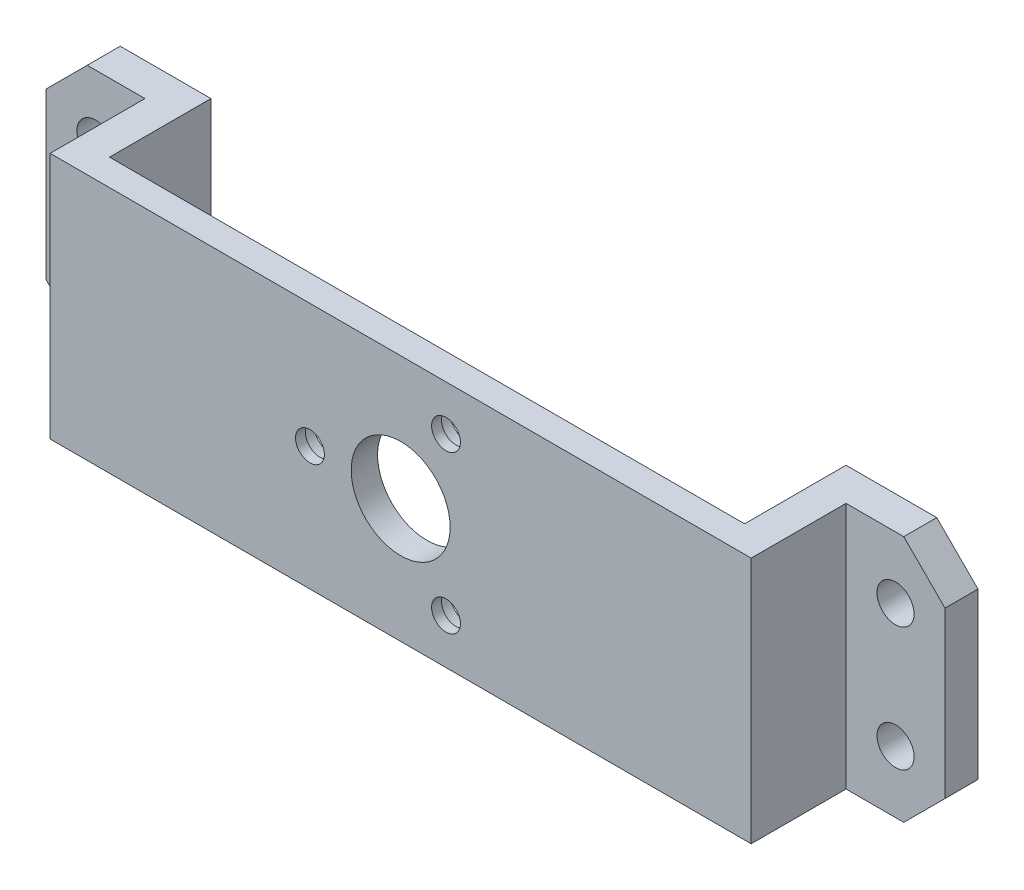
ISO-10303-21;
HEADER;
FILE_DESCRIPTION(('STEP AP214'),'2;1');
FILE_NAME('part.step','',(''),(''),'','','');
FILE_SCHEMA(('AUTOMOTIVE_DESIGN { 1 0 10303 214 1 1 1 1 }'));
ENDSEC;
DATA;
#1=APPLICATION_CONTEXT('core data for automotive mechanical design processes');
#2=APPLICATION_PROTOCOL_DEFINITION('international standard','automotive_design',2000,#1);
#3=PRODUCT_CONTEXT('',#1,'mechanical');
#4=PRODUCT('Part','Part','',(#3));
#5=PRODUCT_RELATED_PRODUCT_CATEGORY('part','',(#4));
#6=PRODUCT_DEFINITION_FORMATION('','',#4);
#7=PRODUCT_DEFINITION_CONTEXT('part definition',#1,'design');
#8=PRODUCT_DEFINITION('design','',#6,#7);
#9=PRODUCT_DEFINITION_SHAPE('','',#8);
#10=(LENGTH_UNIT() NAMED_UNIT(*) SI_UNIT(.MILLI.,.METRE.));
#11=(NAMED_UNIT(*) PLANE_ANGLE_UNIT() SI_UNIT($,.RADIAN.));
#12=(NAMED_UNIT(*) SI_UNIT($,.STERADIAN.) SOLID_ANGLE_UNIT());
#13=UNCERTAINTY_MEASURE_WITH_UNIT(LENGTH_MEASURE(1.E-05),#10,'distance_accuracy_value','');
#14=(GEOMETRIC_REPRESENTATION_CONTEXT(3) GLOBAL_UNCERTAINTY_ASSIGNED_CONTEXT((#13)) GLOBAL_UNIT_ASSIGNED_CONTEXT((#10,
#11,#12)) REPRESENTATION_CONTEXT('',''));
#15=CARTESIAN_POINT('',(0.,0.,0.));
#16=DIRECTION('',(0.,0.,1.));
#17=DIRECTION('',(1.,0.,0.));
#18=AXIS2_PLACEMENT_3D('',#15,#16,#17);
#19=CARTESIAN_POINT('',(42.5,-15.,3.2));
#20=DIRECTION('',(-1.,0.,0.));
#21=DIRECTION('',(0.,0.,1.));
#22=AXIS2_PLACEMENT_3D('',#19,#20,#21);
#23=PLANE('',#22);
#24=DIRECTION('',(0.,-1.,0.));
#25=VECTOR('',#24,1.);
#26=CARTESIAN_POINT('',(42.5,-15.,-8.3));
#27=LINE('',#26,#25);
#28=CARTESIAN_POINT('',(42.5,15.,-8.3));
#29=VERTEX_POINT('',#28);
#30=CARTESIAN_POINT('',(42.5,-15.,-8.3));
#31=VERTEX_POINT('',#30);
#32=EDGE_CURVE('E156',#29,#31,#27,.T.);
#33=ORIENTED_EDGE('',*,*,#32,.F.);
#34=DIRECTION('',(0.,0.,-1.));
#35=VECTOR('',#34,1.);
#36=CARTESIAN_POINT('',(42.5,15.,3.2));
#37=LINE('',#36,#35);
#38=CARTESIAN_POINT('',(42.5,15.,3.2));
#39=VERTEX_POINT('',#38);
#40=EDGE_CURVE('E170',#39,#29,#37,.T.);
#41=ORIENTED_EDGE('',*,*,#40,.F.);
#42=DIRECTION('',(0.,1.,0.));
#43=VECTOR('',#42,1.);
#44=CARTESIAN_POINT('',(42.5,-15.,3.2));
#45=LINE('',#44,#43);
#46=CARTESIAN_POINT('',(42.5,-15.,3.2));
#47=VERTEX_POINT('',#46);
#48=EDGE_CURVE('E386',#47,#39,#45,.T.);
#49=ORIENTED_EDGE('',*,*,#48,.F.);
#50=DIRECTION('',(0.,0.,-1.));
#51=VECTOR('',#50,1.);
#52=CARTESIAN_POINT('',(42.5,-15.,3.2));
#53=LINE('',#52,#51);
#54=EDGE_CURVE('E172',#47,#31,#53,.T.);
#55=ORIENTED_EDGE('',*,*,#54,.T.);
#56=EDGE_LOOP('',(#33,#41,#49,#55));
#57=FACE_BOUND('',#56,.T.);
#58=ADVANCED_FACE('F40',(#57),#23,.F.);
#59=CARTESIAN_POINT('',(0.,0.,0.));
#60=DIRECTION('',(0.,0.,-1.));
#61=DIRECTION('',(-1.,0.,0.));
#62=AXIS2_PLACEMENT_3D('',#59,#60,#61);
#63=PLANE('',#62);
#64=CARTESIAN_POINT('',(5.50000000000004,9.5262794416288,0.));
#65=DIRECTION('',(0.,0.,-1.));
#66=DIRECTION('',(-1.,0.,0.));
#67=AXIS2_PLACEMENT_3D('',#64,#65,#66);
#68=CIRCLE('',#67,3.);
#69=CARTESIAN_POINT('',(2.50000000000004,9.5262794416288,0.));
#70=VERTEX_POINT('',#69);
#71=EDGE_CURVE('E347',#70,#70,#68,.T.);
#72=ORIENTED_EDGE('',*,*,#71,.F.);
#73=EDGE_LOOP('',(#72));
#74=FACE_BOUND('',#73,.T.);
#75=CARTESIAN_POINT('',(-11.,0.,0.));
#76=DIRECTION('',(0.,0.,-1.));
#77=DIRECTION('',(-1.,0.,0.));
#78=AXIS2_PLACEMENT_3D('',#75,#76,#77);
#79=CIRCLE('',#78,3.);
#80=CARTESIAN_POINT('',(-14.,0.,0.));
#81=VERTEX_POINT('',#80);
#82=EDGE_CURVE('E355',#81,#81,#79,.T.);
#83=ORIENTED_EDGE('',*,*,#82,.F.);
#84=EDGE_LOOP('',(#83));
#85=FACE_BOUND('',#84,.T.);
#86=CARTESIAN_POINT('',(5.50000000000005,-9.5262794416288,0.));
#87=DIRECTION('',(0.,0.,-1.));
#88=DIRECTION('',(-1.,0.,0.));
#89=AXIS2_PLACEMENT_3D('',#86,#87,#88);
#90=CIRCLE('',#89,3.);
#91=CARTESIAN_POINT('',(2.50000000000005,-9.5262794416288,0.));
#92=VERTEX_POINT('',#91);
#93=EDGE_CURVE('E332',#92,#92,#90,.T.);
#94=ORIENTED_EDGE('',*,*,#93,.F.);
#95=EDGE_LOOP('',(#94));
#96=FACE_BOUND('',#95,.T.);
#97=CARTESIAN_POINT('',(0.,0.,0.));
#98=DIRECTION('',(0.,0.,1.));
#99=DIRECTION('',(1.,0.,0.));
#100=AXIS2_PLACEMENT_3D('',#97,#98,#99);
#101=CIRCLE('',#100,6.);
#102=CARTESIAN_POINT('',(6.,0.,0.));
#103=VERTEX_POINT('',#102);
#104=EDGE_CURVE('E370',#103,#103,#101,.T.);
#105=ORIENTED_EDGE('',*,*,#104,.T.);
#106=EDGE_LOOP('',(#105));
#107=FACE_BOUND('',#106,.T.);
#108=DIRECTION('',(-1.,0.,0.));
#109=VECTOR('',#108,1.);
#110=CARTESIAN_POINT('',(-42.5,15.,0.));
#111=LINE('',#110,#109);
#112=CARTESIAN_POINT('',(38.5,15.,0.));
#113=VERTEX_POINT('',#112);
#114=CARTESIAN_POINT('',(-38.5,15.,0.));
#115=VERTEX_POINT('',#114);
#116=EDGE_CURVE('E382',#113,#115,#111,.T.);
#117=ORIENTED_EDGE('',*,*,#116,.F.);
#118=DIRECTION('',(0.,1.,0.));
#119=VECTOR('',#118,1.);
#120=CARTESIAN_POINT('',(38.5,-15.,0.));
#121=LINE('',#120,#119);
#122=CARTESIAN_POINT('',(38.5,-15.,0.));
#123=VERTEX_POINT('',#122);
#124=EDGE_CURVE('E303',#123,#113,#121,.T.);
#125=ORIENTED_EDGE('',*,*,#124,.F.);
#126=DIRECTION('',(1.,0.,0.));
#127=VECTOR('',#126,1.);
#128=CARTESIAN_POINT('',(-42.5,-15.,0.));
#129=LINE('',#128,#127);
#130=CARTESIAN_POINT('',(-38.5,-15.,0.));
#131=VERTEX_POINT('',#130);
#132=EDGE_CURVE('E389',#131,#123,#129,.T.);
#133=ORIENTED_EDGE('',*,*,#132,.F.);
#134=DIRECTION('',(0.,-1.,0.));
#135=VECTOR('',#134,1.);
#136=CARTESIAN_POINT('',(-38.5,-15.,0.));
#137=LINE('',#136,#135);
#138=EDGE_CURVE('E323',#115,#131,#137,.T.);
#139=ORIENTED_EDGE('',*,*,#138,.F.);
#140=EDGE_LOOP('',(#117,#125,#133,#139));
#141=FACE_BOUND('',#140,.T.);
#142=ADVANCED_FACE('F441',(#74,#85,#96,#107,#141),#63,.T.);
#143=CARTESIAN_POINT('',(5.50000000000005,-9.5262794416288,0.));
#144=DIRECTION('',(0.,0.,1.));
#145=DIRECTION('',(1.,0.,0.));
#146=AXIS2_PLACEMENT_3D('',#143,#144,#145);
#147=CYLINDRICAL_SURFACE('',#146,1.75);
#148=CARTESIAN_POINT('',(5.50000000000005,-9.5262794416288,3.2));
#149=DIRECTION('',(0.,0.,1.));
#150=DIRECTION('',(1.,0.,0.));
#151=AXIS2_PLACEMENT_3D('',#148,#149,#150);
#152=CIRCLE('',#151,1.75);
#153=CARTESIAN_POINT('',(7.25000000000005,-9.5262794416288,3.2));
#154=VERTEX_POINT('',#153);
#155=EDGE_CURVE('E207',#154,#154,#152,.T.);
#156=ORIENTED_EDGE('',*,*,#155,.T.);
#157=EDGE_LOOP('',(#156));
#158=FACE_BOUND('',#157,.T.);
#159=CARTESIAN_POINT('',(5.50000000000005,-9.5262794416288,2.));
#160=DIRECTION('',(0.,0.,-1.));
#161=DIRECTION('',(-1.,0.,0.));
#162=AXIS2_PLACEMENT_3D('',#159,#160,#161);
#163=CIRCLE('',#162,1.75);
#164=CARTESIAN_POINT('',(3.75000000000005,-9.5262794416288,2.));
#165=VERTEX_POINT('',#164);
#166=EDGE_CURVE('E204',#165,#165,#163,.F.);
#167=ORIENTED_EDGE('',*,*,#166,.F.);
#168=EDGE_LOOP('',(#167));
#169=FACE_BOUND('',#168,.T.);
#170=ADVANCED_FACE('F461',(#158,#169),#147,.F.);
#171=CARTESIAN_POINT('',(-11.,0.,0.));
#172=DIRECTION('',(0.,0.,1.));
#173=DIRECTION('',(1.,0.,0.));
#174=AXIS2_PLACEMENT_3D('',#171,#172,#173);
#175=CYLINDRICAL_SURFACE('',#174,1.75);
#176=CARTESIAN_POINT('',(-11.,0.,3.2));
#177=DIRECTION('',(0.,0.,1.));
#178=DIRECTION('',(1.,0.,0.));
#179=AXIS2_PLACEMENT_3D('',#176,#177,#178);
#180=CIRCLE('',#179,1.75);
#181=CARTESIAN_POINT('',(-9.25,0.,3.2));
#182=VERTEX_POINT('',#181);
#183=EDGE_CURVE('E371',#182,#182,#180,.T.);
#184=ORIENTED_EDGE('',*,*,#183,.T.);
#185=EDGE_LOOP('',(#184));
#186=FACE_BOUND('',#185,.T.);
#187=CARTESIAN_POINT('',(-11.,0.,2.));
#188=DIRECTION('',(0.,0.,-1.));
#189=DIRECTION('',(-1.,0.,0.));
#190=AXIS2_PLACEMENT_3D('',#187,#188,#189);
#191=CIRCLE('',#190,1.75);
#192=CARTESIAN_POINT('',(-12.75,0.,2.));
#193=VERTEX_POINT('',#192);
#194=EDGE_CURVE('E199',#193,#193,#191,.F.);
#195=ORIENTED_EDGE('',*,*,#194,.F.);
#196=EDGE_LOOP('',(#195));
#197=FACE_BOUND('',#196,.T.);
#198=ADVANCED_FACE('F529',(#186,#197),#175,.F.);
#199=CARTESIAN_POINT('',(5.50000000000004,9.5262794416288,0.));
#200=DIRECTION('',(0.,0.,1.));
#201=DIRECTION('',(1.,0.,0.));
#202=AXIS2_PLACEMENT_3D('',#199,#200,#201);
#203=CYLINDRICAL_SURFACE('',#202,1.75);
#204=CARTESIAN_POINT('',(5.50000000000004,9.5262794416288,3.2));
#205=DIRECTION('',(0.,0.,1.));
#206=DIRECTION('',(1.,0.,0.));
#207=AXIS2_PLACEMENT_3D('',#204,#205,#206);
#208=CIRCLE('',#207,1.75);
#209=CARTESIAN_POINT('',(7.25000000000004,9.5262794416288,3.2));
#210=VERTEX_POINT('',#209);
#211=EDGE_CURVE('E366',#210,#210,#208,.T.);
#212=ORIENTED_EDGE('',*,*,#211,.T.);
#213=EDGE_LOOP('',(#212));
#214=FACE_BOUND('',#213,.T.);
#215=CARTESIAN_POINT('',(5.50000000000004,9.5262794416288,2.));
#216=DIRECTION('',(0.,0.,-1.));
#217=DIRECTION('',(-1.,0.,0.));
#218=AXIS2_PLACEMENT_3D('',#215,#216,#217);
#219=CIRCLE('',#218,1.75);
#220=CARTESIAN_POINT('',(3.75000000000004,9.5262794416288,2.));
#221=VERTEX_POINT('',#220);
#222=EDGE_CURVE('E195',#221,#221,#219,.F.);
#223=ORIENTED_EDGE('',*,*,#222,.F.);
#224=EDGE_LOOP('',(#223));
#225=FACE_BOUND('',#224,.T.);
#226=ADVANCED_FACE('F525',(#214,#225),#203,.F.);
#227=CARTESIAN_POINT('',(0.,0.,3.2));
#228=DIRECTION('',(0.,0.,-1.));
#229=DIRECTION('',(-1.,0.,0.));
#230=AXIS2_PLACEMENT_3D('',#227,#228,#229);
#231=PLANE('',#230);
#232=ORIENTED_EDGE('',*,*,#211,.F.);
#233=EDGE_LOOP('',(#232));
#234=FACE_BOUND('',#233,.T.);
#235=ORIENTED_EDGE('',*,*,#183,.F.);
#236=EDGE_LOOP('',(#235));
#237=FACE_BOUND('',#236,.T.);
#238=ORIENTED_EDGE('',*,*,#155,.F.);
#239=EDGE_LOOP('',(#238));
#240=FACE_BOUND('',#239,.T.);
#241=ORIENTED_EDGE('',*,*,#48,.T.);
#242=DIRECTION('',(-1.,0.,0.));
#243=VECTOR('',#242,1.);
#244=CARTESIAN_POINT('',(-42.5,15.,3.2));
#245=LINE('',#244,#243);
#246=CARTESIAN_POINT('',(-42.5,15.,3.2));
#247=VERTEX_POINT('',#246);
#248=EDGE_CURVE('E180',#39,#247,#245,.T.);
#249=ORIENTED_EDGE('',*,*,#248,.T.);
#250=DIRECTION('',(0.,-1.,0.));
#251=VECTOR('',#250,1.);
#252=CARTESIAN_POINT('',(-42.5,-15.,3.2));
#253=LINE('',#252,#251);
#254=CARTESIAN_POINT('',(-42.5,-15.,3.2));
#255=VERTEX_POINT('',#254);
#256=EDGE_CURVE('E392',#247,#255,#253,.T.);
#257=ORIENTED_EDGE('',*,*,#256,.T.);
#258=DIRECTION('',(1.,0.,0.));
#259=VECTOR('',#258,1.);
#260=CARTESIAN_POINT('',(-42.5,-15.,3.2));
#261=LINE('',#260,#259);
#262=EDGE_CURVE('E395',#255,#47,#261,.T.);
#263=ORIENTED_EDGE('',*,*,#262,.T.);
#264=EDGE_LOOP('',(#241,#249,#257,#263));
#265=FACE_BOUND('',#264,.T.);
#266=CARTESIAN_POINT('',(0.,0.,3.2));
#267=DIRECTION('',(0.,0.,1.));
#268=DIRECTION('',(1.,0.,0.));
#269=AXIS2_PLACEMENT_3D('',#266,#267,#268);
#270=CIRCLE('',#269,6.);
#271=CARTESIAN_POINT('',(6.,0.,3.2));
#272=VERTEX_POINT('',#271);
#273=EDGE_CURVE('E378',#272,#272,#270,.T.);
#274=ORIENTED_EDGE('',*,*,#273,.F.);
#275=EDGE_LOOP('',(#274));
#276=FACE_BOUND('',#275,.T.);
#277=ADVANCED_FACE('F528',(#234,#237,#240,#265,#276),#231,.F.);
#278=CARTESIAN_POINT('',(-42.5,15.,3.2));
#279=DIRECTION('',(0.,-1.,0.));
#280=DIRECTION('',(0.,0.,-1.));
#281=AXIS2_PLACEMENT_3D('',#278,#279,#280);
#282=PLANE('',#281);
#283=DIRECTION('',(1.,0.,0.));
#284=VECTOR('',#283,1.);
#285=CARTESIAN_POINT('',(-42.5,15.,-12.3));
#286=LINE('',#285,#284);
#287=CARTESIAN_POINT('',(-49.5,15.,-12.3));
#288=VERTEX_POINT('',#287);
#289=CARTESIAN_POINT('',(-38.5,15.,-12.3));
#290=VERTEX_POINT('',#289);
#291=EDGE_CURVE('E333',#288,#290,#286,.T.);
#292=ORIENTED_EDGE('',*,*,#291,.F.);
#293=DIRECTION('',(0.,0.,1.));
#294=VECTOR('',#293,1.);
#295=CARTESIAN_POINT('',(-49.5,15.,-8.3));
#296=LINE('',#295,#294);
#297=CARTESIAN_POINT('',(-49.5,15.,-8.3));
#298=VERTEX_POINT('',#297);
#299=EDGE_CURVE('E221',#288,#298,#296,.T.);
#300=ORIENTED_EDGE('',*,*,#299,.T.);
#301=DIRECTION('',(1.,0.,0.));
#302=VECTOR('',#301,1.);
#303=CARTESIAN_POINT('',(-38.5,15.,-8.3));
#304=LINE('',#303,#302);
#305=CARTESIAN_POINT('',(-42.5,15.,-8.3));
#306=VERTEX_POINT('',#305);
#307=EDGE_CURVE('E292',#298,#306,#304,.T.);
#308=ORIENTED_EDGE('',*,*,#307,.T.);
#309=DIRECTION('',(0.,0.,-1.));
#310=VECTOR('',#309,1.);
#311=CARTESIAN_POINT('',(-42.5,15.,3.2));
#312=LINE('',#311,#310);
#313=EDGE_CURVE('E184',#247,#306,#312,.T.);
#314=ORIENTED_EDGE('',*,*,#313,.F.);
#315=ORIENTED_EDGE('',*,*,#248,.F.);
#316=ORIENTED_EDGE('',*,*,#40,.T.);
#317=DIRECTION('',(1.,0.,0.));
#318=VECTOR('',#317,1.);
#319=CARTESIAN_POINT('',(38.5,15.,-8.3));
#320=LINE('',#319,#318);
#321=CARTESIAN_POINT('',(49.5,15.,-8.3));
#322=VERTEX_POINT('',#321);
#323=EDGE_CURVE('E153',#29,#322,#320,.T.);
#324=ORIENTED_EDGE('',*,*,#323,.T.);
#325=DIRECTION('',(0.,0.,-1.));
#326=VECTOR('',#325,1.);
#327=CARTESIAN_POINT('',(49.5,15.,-12.3));
#328=LINE('',#327,#326);
#329=CARTESIAN_POINT('',(49.5,15.,-12.3));
#330=VERTEX_POINT('',#329);
#331=EDGE_CURVE('E218',#322,#330,#328,.T.);
#332=ORIENTED_EDGE('',*,*,#331,.T.);
#333=DIRECTION('',(1.,0.,0.));
#334=VECTOR('',#333,1.);
#335=CARTESIAN_POINT('',(42.5,15.,-12.3));
#336=LINE('',#335,#334);
#337=CARTESIAN_POINT('',(38.5,15.,-12.3));
#338=VERTEX_POINT('',#337);
#339=EDGE_CURVE('E316',#338,#330,#336,.T.);
#340=ORIENTED_EDGE('',*,*,#339,.F.);
#341=DIRECTION('',(0.,0.,1.));
#342=VECTOR('',#341,1.);
#343=CARTESIAN_POINT('',(38.5,15.,-58.0654919008431));
#344=LINE('',#343,#342);
#345=EDGE_CURVE('E307',#338,#113,#344,.T.);
#346=ORIENTED_EDGE('',*,*,#345,.T.);
#347=ORIENTED_EDGE('',*,*,#116,.T.);
#348=DIRECTION('',(0.,0.,1.));
#349=VECTOR('',#348,1.);
#350=CARTESIAN_POINT('',(-38.5,15.,-58.0654919008431));
#351=LINE('',#350,#349);
#352=EDGE_CURVE('E312',#290,#115,#351,.T.);
#353=ORIENTED_EDGE('',*,*,#352,.F.);
#354=EDGE_LOOP('',(#292,#300,#308,#314,#315,#316,#324,#332,#340,#346,#347,#353));
#355=FACE_BOUND('',#354,.T.);
#356=ADVANCED_FACE('F178',(#355),#282,.F.);
#357=CARTESIAN_POINT('',(-42.5,-15.,3.2));
#358=DIRECTION('',(1.,0.,0.));
#359=DIRECTION('',(0.,0.,-1.));
#360=AXIS2_PLACEMENT_3D('',#357,#358,#359);
#361=PLANE('',#360);
#362=ORIENTED_EDGE('',*,*,#313,.T.);
#363=DIRECTION('',(0.,-1.,0.));
#364=VECTOR('',#363,1.);
#365=CARTESIAN_POINT('',(-42.5,-15.,-8.3));
#366=LINE('',#365,#364);
#367=CARTESIAN_POINT('',(-42.5,-15.,-8.3));
#368=VERTEX_POINT('',#367);
#369=EDGE_CURVE('E295',#306,#368,#366,.T.);
#370=ORIENTED_EDGE('',*,*,#369,.T.);
#371=DIRECTION('',(0.,0.,-1.));
#372=VECTOR('',#371,1.);
#373=CARTESIAN_POINT('',(-42.5,-15.,3.2));
#374=LINE('',#373,#372);
#375=EDGE_CURVE('E191',#255,#368,#374,.T.);
#376=ORIENTED_EDGE('',*,*,#375,.F.);
#377=ORIENTED_EDGE('',*,*,#256,.F.);
#378=EDGE_LOOP('',(#362,#370,#376,#377));
#379=FACE_BOUND('',#378,.T.);
#380=ADVANCED_FACE('F414',(#379),#361,.F.);
#381=CARTESIAN_POINT('',(-42.5,-15.,3.2));
#382=DIRECTION('',(0.,1.,0.));
#383=DIRECTION('',(0.,0.,1.));
#384=AXIS2_PLACEMENT_3D('',#381,#382,#383);
#385=PLANE('',#384);
#386=DIRECTION('',(-1.,0.,0.));
#387=VECTOR('',#386,1.);
#388=CARTESIAN_POINT('',(-38.5,-15.,-8.3));
#389=LINE('',#388,#387);
#390=CARTESIAN_POINT('',(-49.5,-15.,-8.3));
#391=VERTEX_POINT('',#390);
#392=EDGE_CURVE('E284',#368,#391,#389,.T.);
#393=ORIENTED_EDGE('',*,*,#392,.T.);
#394=DIRECTION('',(0.,0.,-1.));
#395=VECTOR('',#394,1.);
#396=CARTESIAN_POINT('',(-49.5,-15.,-12.3));
#397=LINE('',#396,#395);
#398=CARTESIAN_POINT('',(-49.5,-15.,-12.3));
#399=VERTEX_POINT('',#398);
#400=EDGE_CURVE('E233',#391,#399,#397,.T.);
#401=ORIENTED_EDGE('',*,*,#400,.T.);
#402=DIRECTION('',(-1.,0.,0.));
#403=VECTOR('',#402,1.);
#404=CARTESIAN_POINT('',(-42.5,-15.,-12.3));
#405=LINE('',#404,#403);
#406=CARTESIAN_POINT('',(-38.5,-15.,-12.3));
#407=VERTEX_POINT('',#406);
#408=EDGE_CURVE('E336',#407,#399,#405,.T.);
#409=ORIENTED_EDGE('',*,*,#408,.F.);
#410=DIRECTION('',(0.,0.,1.));
#411=VECTOR('',#410,1.);
#412=CARTESIAN_POINT('',(-38.5,-15.,-58.0654919008431));
#413=LINE('',#412,#411);
#414=EDGE_CURVE('E327',#407,#131,#413,.T.);
#415=ORIENTED_EDGE('',*,*,#414,.T.);
#416=ORIENTED_EDGE('',*,*,#132,.T.);
#417=DIRECTION('',(0.,0.,1.));
#418=VECTOR('',#417,1.);
#419=CARTESIAN_POINT('',(38.5,-15.,-58.0654919008431));
#420=LINE('',#419,#418);
#421=CARTESIAN_POINT('',(38.5,-15.,-12.3));
#422=VERTEX_POINT('',#421);
#423=EDGE_CURVE('E302',#422,#123,#420,.T.);
#424=ORIENTED_EDGE('',*,*,#423,.F.);
#425=DIRECTION('',(-1.,0.,0.));
#426=VECTOR('',#425,1.);
#427=CARTESIAN_POINT('',(42.5,-15.,-12.3));
#428=LINE('',#427,#426);
#429=CARTESIAN_POINT('',(49.5,-15.,-12.3));
#430=VERTEX_POINT('',#429);
#431=EDGE_CURVE('E313',#430,#422,#428,.T.);
#432=ORIENTED_EDGE('',*,*,#431,.F.);
#433=DIRECTION('',(0.,0.,1.));
#434=VECTOR('',#433,1.);
#435=CARTESIAN_POINT('',(49.5,-15.,-8.3));
#436=LINE('',#435,#434);
#437=CARTESIAN_POINT('',(49.5,-15.,-8.3));
#438=VERTEX_POINT('',#437);
#439=EDGE_CURVE('E230',#430,#438,#436,.T.);
#440=ORIENTED_EDGE('',*,*,#439,.T.);
#441=DIRECTION('',(-1.,0.,0.));
#442=VECTOR('',#441,1.);
#443=CARTESIAN_POINT('',(38.5,-15.,-8.3));
#444=LINE('',#443,#442);
#445=EDGE_CURVE('E175',#438,#31,#444,.T.);
#446=ORIENTED_EDGE('',*,*,#445,.T.);
#447=ORIENTED_EDGE('',*,*,#54,.F.);
#448=ORIENTED_EDGE('',*,*,#262,.F.);
#449=ORIENTED_EDGE('',*,*,#375,.T.);
#450=EDGE_LOOP('',(#393,#401,#409,#415,#416,#424,#432,#440,#446,#447,#448,#449));
#451=FACE_BOUND('',#450,.T.);
#452=ADVANCED_FACE('F410',(#451),#385,.F.);
#453=CARTESIAN_POINT('',(0.,0.,3.2));
#454=DIRECTION('',(0.,0.,-1.));
#455=DIRECTION('',(-1.,0.,0.));
#456=AXIS2_PLACEMENT_3D('',#453,#454,#455);
#457=CYLINDRICAL_SURFACE('',#456,6.);
#458=ORIENTED_EDGE('',*,*,#273,.T.);
#459=EDGE_LOOP('',(#458));
#460=FACE_BOUND('',#459,.T.);
#461=ORIENTED_EDGE('',*,*,#104,.F.);
#462=EDGE_LOOP('',(#461));
#463=FACE_BOUND('',#462,.T.);
#464=ADVANCED_FACE('F505',(#460,#463),#457,.F.);
#465=CARTESIAN_POINT('',(5.50000000000004,9.5262794416288,2.));
#466=DIRECTION('',(0.,0.,-1.));
#467=DIRECTION('',(-1.,0.,0.));
#468=AXIS2_PLACEMENT_3D('',#465,#466,#467);
#469=PLANE('',#468);
#470=CARTESIAN_POINT('',(5.50000000000004,9.5262794416288,2.));
#471=DIRECTION('',(0.,0.,-1.));
#472=DIRECTION('',(-1.,0.,0.));
#473=AXIS2_PLACEMENT_3D('',#470,#471,#472);
#474=CIRCLE('',#473,3.);
#475=CARTESIAN_POINT('',(2.50000000000004,9.5262794416288,2.));
#476=VERTEX_POINT('',#475);
#477=EDGE_CURVE('E200',#476,#476,#474,.T.);
#478=ORIENTED_EDGE('',*,*,#477,.T.);
#479=EDGE_LOOP('',(#478));
#480=FACE_BOUND('',#479,.T.);
#481=ORIENTED_EDGE('',*,*,#222,.T.);
#482=EDGE_LOOP('',(#481));
#483=FACE_BOUND('',#482,.T.);
#484=ADVANCED_FACE('F501',(#480,#483),#469,.T.);
#485=CARTESIAN_POINT('',(5.50000000000004,9.5262794416288,2.));
#486=DIRECTION('',(0.,0.,-1.));
#487=DIRECTION('',(-1.,0.,0.));
#488=AXIS2_PLACEMENT_3D('',#485,#486,#487);
#489=CYLINDRICAL_SURFACE('',#488,3.);
#490=ORIENTED_EDGE('',*,*,#477,.F.);
#491=EDGE_LOOP('',(#490));
#492=FACE_BOUND('',#491,.T.);
#493=ORIENTED_EDGE('',*,*,#71,.T.);
#494=EDGE_LOOP('',(#493));
#495=FACE_BOUND('',#494,.T.);
#496=ADVANCED_FACE('F504',(#492,#495),#489,.F.);
#497=CARTESIAN_POINT('',(-11.,0.,2.));
#498=DIRECTION('',(0.,0.,-1.));
#499=DIRECTION('',(-1.,0.,0.));
#500=AXIS2_PLACEMENT_3D('',#497,#498,#499);
#501=PLANE('',#500);
#502=CARTESIAN_POINT('',(-11.,0.,2.));
#503=DIRECTION('',(0.,0.,-1.));
#504=DIRECTION('',(-1.,0.,0.));
#505=AXIS2_PLACEMENT_3D('',#502,#503,#504);
#506=CIRCLE('',#505,3.);
#507=CARTESIAN_POINT('',(-14.,0.,2.));
#508=VERTEX_POINT('',#507);
#509=EDGE_CURVE('E351',#508,#508,#506,.T.);
#510=ORIENTED_EDGE('',*,*,#509,.T.);
#511=EDGE_LOOP('',(#510));
#512=FACE_BOUND('',#511,.T.);
#513=ORIENTED_EDGE('',*,*,#194,.T.);
#514=EDGE_LOOP('',(#513));
#515=FACE_BOUND('',#514,.T.);
#516=ADVANCED_FACE('F509',(#512,#515),#501,.T.);
#517=CARTESIAN_POINT('',(-11.,0.,2.));
#518=DIRECTION('',(0.,0.,-1.));
#519=DIRECTION('',(-1.,0.,0.));
#520=AXIS2_PLACEMENT_3D('',#517,#518,#519);
#521=CYLINDRICAL_SURFACE('',#520,3.);
#522=ORIENTED_EDGE('',*,*,#509,.F.);
#523=EDGE_LOOP('',(#522));
#524=FACE_BOUND('',#523,.T.);
#525=ORIENTED_EDGE('',*,*,#82,.T.);
#526=EDGE_LOOP('',(#525));
#527=FACE_BOUND('',#526,.T.);
#528=ADVANCED_FACE('F513',(#524,#527),#521,.F.);
#529=CARTESIAN_POINT('',(5.50000000000005,-9.5262794416288,2.));
#530=DIRECTION('',(0.,0.,-1.));
#531=DIRECTION('',(-1.,0.,0.));
#532=AXIS2_PLACEMENT_3D('',#529,#530,#531);
#533=PLANE('',#532);
#534=CARTESIAN_POINT('',(5.50000000000005,-9.5262794416288,2.));
#535=DIRECTION('',(0.,0.,-1.));
#536=DIRECTION('',(-1.,0.,0.));
#537=AXIS2_PLACEMENT_3D('',#534,#535,#536);
#538=CIRCLE('',#537,3.);
#539=CARTESIAN_POINT('',(2.50000000000005,-9.5262794416288,2.));
#540=VERTEX_POINT('',#539);
#541=EDGE_CURVE('E359',#540,#540,#538,.T.);
#542=ORIENTED_EDGE('',*,*,#541,.T.);
#543=EDGE_LOOP('',(#542));
#544=FACE_BOUND('',#543,.T.);
#545=ORIENTED_EDGE('',*,*,#166,.T.);
#546=EDGE_LOOP('',(#545));
#547=FACE_BOUND('',#546,.T.);
#548=ADVANCED_FACE('F517',(#544,#547),#533,.T.);
#549=CARTESIAN_POINT('',(5.50000000000005,-9.5262794416288,2.));
#550=DIRECTION('',(0.,0.,-1.));
#551=DIRECTION('',(-1.,0.,0.));
#552=AXIS2_PLACEMENT_3D('',#549,#550,#551);
#553=CYLINDRICAL_SURFACE('',#552,3.);
#554=ORIENTED_EDGE('',*,*,#541,.F.);
#555=EDGE_LOOP('',(#554));
#556=FACE_BOUND('',#555,.T.);
#557=ORIENTED_EDGE('',*,*,#93,.T.);
#558=EDGE_LOOP('',(#557));
#559=FACE_BOUND('',#558,.T.);
#560=ADVANCED_FACE('F498',(#556,#559),#553,.F.);
#561=CARTESIAN_POINT('',(-38.5,-15.,-58.0654919008431));
#562=DIRECTION('',(-1.,0.,0.));
#563=DIRECTION('',(0.,0.,1.));
#564=AXIS2_PLACEMENT_3D('',#561,#562,#563);
#565=PLANE('',#564);
#566=ORIENTED_EDGE('',*,*,#138,.T.);
#567=ORIENTED_EDGE('',*,*,#414,.F.);
#568=DIRECTION('',(0.,-1.,0.));
#569=VECTOR('',#568,1.);
#570=CARTESIAN_POINT('',(-38.5,-15.,-12.3));
#571=LINE('',#570,#569);
#572=EDGE_CURVE('E328',#290,#407,#571,.T.);
#573=ORIENTED_EDGE('',*,*,#572,.F.);
#574=ORIENTED_EDGE('',*,*,#352,.T.);
#575=EDGE_LOOP('',(#566,#567,#573,#574));
#576=FACE_BOUND('',#575,.T.);
#577=ADVANCED_FACE('F433',(#576),#565,.F.);
#578=CARTESIAN_POINT('',(0.,0.,-12.3));
#579=DIRECTION('',(0.,0.,-1.));
#580=DIRECTION('',(-1.,0.,0.));
#581=AXIS2_PLACEMENT_3D('',#578,#579,#580);
#582=PLANE('',#581);
#583=DIRECTION('',(0.,1.,0.));
#584=VECTOR('',#583,1.);
#585=CARTESIAN_POINT('',(-54.5,-15.,-12.3));
#586=LINE('',#585,#584);
#587=CARTESIAN_POINT('',(-54.5,-9.99999999999998,-12.3));
#588=VERTEX_POINT('',#587);
#589=CARTESIAN_POINT('',(-54.5,10.,-12.3));
#590=VERTEX_POINT('',#589);
#591=EDGE_CURVE('E280',#588,#590,#586,.T.);
#592=ORIENTED_EDGE('',*,*,#591,.T.);
#593=DIRECTION('',(0.707106781186548,0.707106781186547,0.));
#594=VECTOR('',#593,1.);
#595=CARTESIAN_POINT('',(-32.25,32.25,-12.3));
#596=LINE('',#595,#594);
#597=EDGE_CURVE('E215',#590,#288,#596,.T.);
#598=ORIENTED_EDGE('',*,*,#597,.T.);
#599=ORIENTED_EDGE('',*,*,#291,.T.);
#600=ORIENTED_EDGE('',*,*,#572,.T.);
#601=ORIENTED_EDGE('',*,*,#408,.T.);
#602=DIRECTION('',(-0.707106781186546,0.70710678118655,0.));
#603=VECTOR('',#602,1.);
#604=CARTESIAN_POINT('',(-32.2500000000001,-32.25,-12.3));
#605=LINE('',#604,#603);
#606=EDGE_CURVE('E212',#399,#588,#605,.T.);
#607=ORIENTED_EDGE('',*,*,#606,.T.);
#608=EDGE_LOOP('',(#592,#598,#599,#600,#601,#607));
#609=FACE_BOUND('',#608,.T.);
#610=CARTESIAN_POINT('',(-48.5,7.5,-12.3));
#611=DIRECTION('',(0.,0.,-1.));
#612=DIRECTION('',(-1.,0.,0.));
#613=AXIS2_PLACEMENT_3D('',#610,#611,#612);
#614=CIRCLE('',#613,2.25);
#615=CARTESIAN_POINT('',(-50.75,7.5,-12.3));
#616=VERTEX_POINT('',#615);
#617=EDGE_CURVE('E174',#616,#616,#614,.T.);
#618=ORIENTED_EDGE('',*,*,#617,.F.);
#619=EDGE_LOOP('',(#618));
#620=FACE_BOUND('',#619,.T.);
#621=CARTESIAN_POINT('',(-48.5,-7.5,-12.3));
#622=DIRECTION('',(0.,0.,-1.));
#623=DIRECTION('',(-1.,0.,0.));
#624=AXIS2_PLACEMENT_3D('',#621,#622,#623);
#625=CIRCLE('',#624,2.25);
#626=CARTESIAN_POINT('',(-50.75,-7.5,-12.3));
#627=VERTEX_POINT('',#626);
#628=EDGE_CURVE('E272',#627,#627,#625,.T.);
#629=ORIENTED_EDGE('',*,*,#628,.F.);
#630=EDGE_LOOP('',(#629));
#631=FACE_BOUND('',#630,.T.);
#632=ADVANCED_FACE('F427',(#609,#620,#631),#582,.T.);
#633=CARTESIAN_POINT('',(38.5,-15.,-58.0654919008431));
#634=DIRECTION('',(1.,0.,0.));
#635=DIRECTION('',(0.,1.,0.));
#636=AXIS2_PLACEMENT_3D('',#633,#634,#635);
#637=PLANE('',#636);
#638=ORIENTED_EDGE('',*,*,#423,.T.);
#639=ORIENTED_EDGE('',*,*,#124,.T.);
#640=ORIENTED_EDGE('',*,*,#345,.F.);
#641=DIRECTION('',(0.,1.,0.));
#642=VECTOR('',#641,1.);
#643=CARTESIAN_POINT('',(38.5,-15.,-12.3));
#644=LINE('',#643,#642);
#645=EDGE_CURVE('E308',#422,#338,#644,.T.);
#646=ORIENTED_EDGE('',*,*,#645,.F.);
#647=EDGE_LOOP('',(#638,#639,#640,#646));
#648=FACE_BOUND('',#647,.T.);
#649=ADVANCED_FACE('F446',(#648),#637,.F.);
#650=CARTESIAN_POINT('',(0.,0.,-12.3));
#651=DIRECTION('',(0.,0.,-1.));
#652=DIRECTION('',(-1.,0.,0.));
#653=AXIS2_PLACEMENT_3D('',#650,#651,#652);
#654=PLANE('',#653);
#655=ORIENTED_EDGE('',*,*,#339,.T.);
#656=DIRECTION('',(0.707106781186545,-0.70710678118655,0.));
#657=VECTOR('',#656,1.);
#658=CARTESIAN_POINT('',(32.2500000000002,32.25,-12.3));
#659=LINE('',#658,#657);
#660=CARTESIAN_POINT('',(54.5,9.99999999999998,-12.3));
#661=VERTEX_POINT('',#660);
#662=EDGE_CURVE('E240',#330,#661,#659,.T.);
#663=ORIENTED_EDGE('',*,*,#662,.T.);
#664=DIRECTION('',(0.,-1.,0.));
#665=VECTOR('',#664,1.);
#666=CARTESIAN_POINT('',(54.5,-15.,-12.3));
#667=LINE('',#666,#665);
#668=CARTESIAN_POINT('',(54.5,-10.,-12.3));
#669=VERTEX_POINT('',#668);
#670=EDGE_CURVE('E165',#661,#669,#667,.T.);
#671=ORIENTED_EDGE('',*,*,#670,.T.);
#672=DIRECTION('',(-0.707106781186549,-0.707106781186546,0.));
#673=VECTOR('',#672,1.);
#674=CARTESIAN_POINT('',(32.2499999999999,-32.25,-12.3));
#675=LINE('',#674,#673);
#676=EDGE_CURVE('E237',#669,#430,#675,.T.);
#677=ORIENTED_EDGE('',*,*,#676,.T.);
#678=ORIENTED_EDGE('',*,*,#431,.T.);
#679=ORIENTED_EDGE('',*,*,#645,.T.);
#680=EDGE_LOOP('',(#655,#663,#671,#677,#678,#679));
#681=FACE_BOUND('',#680,.T.);
#682=CARTESIAN_POINT('',(48.5,7.5,-12.3));
#683=DIRECTION('',(0.,0.,-1.));
#684=DIRECTION('',(-1.,0.,0.));
#685=AXIS2_PLACEMENT_3D('',#682,#683,#684);
#686=CIRCLE('',#685,2.25);
#687=CARTESIAN_POINT('',(46.25,7.5,-12.3));
#688=VERTEX_POINT('',#687);
#689=EDGE_CURVE('E263',#688,#688,#686,.T.);
#690=ORIENTED_EDGE('',*,*,#689,.F.);
#691=EDGE_LOOP('',(#690));
#692=FACE_BOUND('',#691,.T.);
#693=CARTESIAN_POINT('',(48.5,-7.5,-12.3));
#694=DIRECTION('',(0.,0.,-1.));
#695=DIRECTION('',(-1.,0.,0.));
#696=AXIS2_PLACEMENT_3D('',#693,#694,#695);
#697=CIRCLE('',#696,2.25);
#698=CARTESIAN_POINT('',(46.25,-7.5,-12.3));
#699=VERTEX_POINT('',#698);
#700=EDGE_CURVE('E788',#699,#699,#697,.T.);
#701=ORIENTED_EDGE('',*,*,#700,.F.);
#702=EDGE_LOOP('',(#701));
#703=FACE_BOUND('',#702,.T.);
#704=ADVANCED_FACE('F255',(#681,#692,#703),#654,.T.);
#705=CARTESIAN_POINT('',(0.,0.,-8.3));
#706=DIRECTION('',(0.,0.,1.));
#707=DIRECTION('',(1.,0.,0.));
#708=AXIS2_PLACEMENT_3D('',#705,#706,#707);
#709=PLANE('',#708);
#710=CARTESIAN_POINT('',(-48.5,-7.5,-8.3));
#711=DIRECTION('',(0.,0.,-1.));
#712=DIRECTION('',(-1.,0.,0.));
#713=AXIS2_PLACEMENT_3D('',#710,#711,#712);
#714=CIRCLE('',#713,2.25);
#715=CARTESIAN_POINT('',(-50.75,-7.5,-8.3));
#716=VERTEX_POINT('',#715);
#717=EDGE_CURVE('E276',#716,#716,#714,.T.);
#718=ORIENTED_EDGE('',*,*,#717,.T.);
#719=EDGE_LOOP('',(#718));
#720=FACE_BOUND('',#719,.T.);
#721=CARTESIAN_POINT('',(-48.5,7.5,-8.3));
#722=DIRECTION('',(0.,0.,-1.));
#723=DIRECTION('',(-1.,0.,0.));
#724=AXIS2_PLACEMENT_3D('',#721,#722,#723);
#725=CIRCLE('',#724,2.25);
#726=CARTESIAN_POINT('',(-50.75,7.5,-8.3));
#727=VERTEX_POINT('',#726);
#728=EDGE_CURVE('E268',#727,#727,#725,.T.);
#729=ORIENTED_EDGE('',*,*,#728,.T.);
#730=EDGE_LOOP('',(#729));
#731=FACE_BOUND('',#730,.T.);
#732=ORIENTED_EDGE('',*,*,#307,.F.);
#733=DIRECTION('',(-0.707106781186548,-0.707106781186547,0.));
#734=VECTOR('',#733,1.);
#735=CARTESIAN_POINT('',(-32.25,32.25,-8.3));
#736=LINE('',#735,#734);
#737=CARTESIAN_POINT('',(-54.5,10.,-8.3));
#738=VERTEX_POINT('',#737);
#739=EDGE_CURVE('E227',#298,#738,#736,.T.);
#740=ORIENTED_EDGE('',*,*,#739,.T.);
#741=DIRECTION('',(0.,1.,0.));
#742=VECTOR('',#741,1.);
#743=CARTESIAN_POINT('',(-54.5,-15.,-8.3));
#744=LINE('',#743,#742);
#745=CARTESIAN_POINT('',(-54.5,-9.99999999999998,-8.3));
#746=VERTEX_POINT('',#745);
#747=EDGE_CURVE('E288',#746,#738,#744,.T.);
#748=ORIENTED_EDGE('',*,*,#747,.F.);
#749=DIRECTION('',(0.707106781186546,-0.70710678118655,0.));
#750=VECTOR('',#749,1.);
#751=CARTESIAN_POINT('',(-32.2500000000001,-32.25,-8.3));
#752=LINE('',#751,#750);
#753=EDGE_CURVE('E224',#746,#391,#752,.T.);
#754=ORIENTED_EDGE('',*,*,#753,.T.);
#755=ORIENTED_EDGE('',*,*,#392,.F.);
#756=ORIENTED_EDGE('',*,*,#369,.F.);
#757=EDGE_LOOP('',(#732,#740,#748,#754,#755,#756));
#758=FACE_BOUND('',#757,.T.);
#759=ADVANCED_FACE('F418',(#720,#731,#758),#709,.T.);
#760=CARTESIAN_POINT('',(-54.5,-15.,-8.3));
#761=DIRECTION('',(-1.,0.,0.));
#762=DIRECTION('',(0.,0.,1.));
#763=AXIS2_PLACEMENT_3D('',#760,#761,#762);
#764=PLANE('',#763);
#765=ORIENTED_EDGE('',*,*,#747,.T.);
#766=DIRECTION('',(0.,0.,-1.));
#767=VECTOR('',#766,1.);
#768=CARTESIAN_POINT('',(-54.5,10.,-12.3));
#769=LINE('',#768,#767);
#770=EDGE_CURVE('E188',#738,#590,#769,.T.);
#771=ORIENTED_EDGE('',*,*,#770,.T.);
#772=ORIENTED_EDGE('',*,*,#591,.F.);
#773=DIRECTION('',(0.,0.,1.));
#774=VECTOR('',#773,1.);
#775=CARTESIAN_POINT('',(-54.5,-9.99999999999998,-8.3));
#776=LINE('',#775,#774);
#777=EDGE_CURVE('E183',#588,#746,#776,.T.);
#778=ORIENTED_EDGE('',*,*,#777,.T.);
#779=EDGE_LOOP('',(#765,#771,#772,#778));
#780=FACE_BOUND('',#779,.T.);
#781=ADVANCED_FACE('F478',(#780),#764,.T.);
#782=CARTESIAN_POINT('',(-48.5,-7.5,-8.3));
#783=DIRECTION('',(0.,0.,-1.));
#784=DIRECTION('',(-1.,0.,0.));
#785=AXIS2_PLACEMENT_3D('',#782,#783,#784);
#786=CYLINDRICAL_SURFACE('',#785,2.25);
#787=ORIENTED_EDGE('',*,*,#717,.F.);
#788=EDGE_LOOP('',(#787));
#789=FACE_BOUND('',#788,.T.);
#790=ORIENTED_EDGE('',*,*,#628,.T.);
#791=EDGE_LOOP('',(#790));
#792=FACE_BOUND('',#791,.T.);
#793=ADVANCED_FACE('F480',(#789,#792),#786,.F.);
#794=CARTESIAN_POINT('',(-48.5,7.5,-8.3));
#795=DIRECTION('',(0.,0.,-1.));
#796=DIRECTION('',(-1.,0.,0.));
#797=AXIS2_PLACEMENT_3D('',#794,#795,#796);
#798=CYLINDRICAL_SURFACE('',#797,2.25);
#799=ORIENTED_EDGE('',*,*,#728,.F.);
#800=EDGE_LOOP('',(#799));
#801=FACE_BOUND('',#800,.T.);
#802=ORIENTED_EDGE('',*,*,#617,.T.);
#803=EDGE_LOOP('',(#802));
#804=FACE_BOUND('',#803,.T.);
#805=ADVANCED_FACE('F486',(#801,#804),#798,.F.);
#806=CARTESIAN_POINT('',(0.,0.,-8.3));
#807=DIRECTION('',(0.,0.,-1.));
#808=DIRECTION('',(-1.,0.,0.));
#809=AXIS2_PLACEMENT_3D('',#806,#807,#808);
#810=PLANE('',#809);
#811=CARTESIAN_POINT('',(48.5,-7.5,-8.3));
#812=DIRECTION('',(0.,0.,-1.));
#813=DIRECTION('',(-1.,0.,0.));
#814=AXIS2_PLACEMENT_3D('',#811,#812,#813);
#815=CIRCLE('',#814,2.25);
#816=CARTESIAN_POINT('',(46.25,-7.5,-8.3));
#817=VERTEX_POINT('',#816);
#818=EDGE_CURVE('E780',#817,#817,#815,.T.);
#819=ORIENTED_EDGE('',*,*,#818,.T.);
#820=EDGE_LOOP('',(#819));
#821=FACE_BOUND('',#820,.T.);
#822=CARTESIAN_POINT('',(48.5,7.5,-8.3));
#823=DIRECTION('',(0.,0.,-1.));
#824=DIRECTION('',(-1.,0.,0.));
#825=AXIS2_PLACEMENT_3D('',#822,#823,#824);
#826=CIRCLE('',#825,2.25);
#827=CARTESIAN_POINT('',(46.25,7.5,-8.3));
#828=VERTEX_POINT('',#827);
#829=EDGE_CURVE('E259',#828,#828,#826,.T.);
#830=ORIENTED_EDGE('',*,*,#829,.T.);
#831=EDGE_LOOP('',(#830));
#832=FACE_BOUND('',#831,.T.);
#833=DIRECTION('',(0.,-1.,0.));
#834=VECTOR('',#833,1.);
#835=CARTESIAN_POINT('',(54.5,-15.,-8.3));
#836=LINE('',#835,#834);
#837=CARTESIAN_POINT('',(54.5,9.99999999999998,-8.3));
#838=VERTEX_POINT('',#837);
#839=CARTESIAN_POINT('',(54.5,-10.,-8.3));
#840=VERTEX_POINT('',#839);
#841=EDGE_CURVE('E164',#838,#840,#836,.T.);
#842=ORIENTED_EDGE('',*,*,#841,.F.);
#843=DIRECTION('',(-0.707106781186545,0.70710678118655,0.));
#844=VECTOR('',#843,1.);
#845=CARTESIAN_POINT('',(49.5,15.,-8.3));
#846=LINE('',#845,#844);
#847=EDGE_CURVE('E12',#838,#322,#846,.T.);
#848=ORIENTED_EDGE('',*,*,#847,.T.);
#849=ORIENTED_EDGE('',*,*,#323,.F.);
#850=ORIENTED_EDGE('',*,*,#32,.T.);
#851=ORIENTED_EDGE('',*,*,#445,.F.);
#852=DIRECTION('',(0.707106781186549,0.707106781186546,0.));
#853=VECTOR('',#852,1.);
#854=CARTESIAN_POINT('',(54.5,-10.,-8.3));
#855=LINE('',#854,#853);
#856=EDGE_CURVE('E49',#438,#840,#855,.T.);
#857=ORIENTED_EDGE('',*,*,#856,.T.);
#858=EDGE_LOOP('',(#842,#848,#849,#850,#851,#857));
#859=FACE_BOUND('',#858,.T.);
#860=ADVANCED_FACE('F155',(#821,#832,#859),#810,.F.);
#861=CARTESIAN_POINT('',(54.5,-15.,-8.3));
#862=DIRECTION('',(1.,0.,0.));
#863=DIRECTION('',(0.,0.,-1.));
#864=AXIS2_PLACEMENT_3D('',#861,#862,#863);
#865=PLANE('',#864);
#866=ORIENTED_EDGE('',*,*,#670,.F.);
#867=DIRECTION('',(0.,0.,1.));
#868=VECTOR('',#867,1.);
#869=CARTESIAN_POINT('',(54.5,9.99999999999998,-8.3));
#870=LINE('',#869,#868);
#871=EDGE_CURVE('E62',#661,#838,#870,.T.);
#872=ORIENTED_EDGE('',*,*,#871,.T.);
#873=ORIENTED_EDGE('',*,*,#841,.T.);
#874=DIRECTION('',(0.,0.,-1.));
#875=VECTOR('',#874,1.);
#876=CARTESIAN_POINT('',(54.5,-10.,-12.3));
#877=LINE('',#876,#875);
#878=EDGE_CURVE('E243',#840,#669,#877,.T.);
#879=ORIENTED_EDGE('',*,*,#878,.T.);
#880=EDGE_LOOP('',(#866,#872,#873,#879));
#881=FACE_BOUND('',#880,.T.);
#882=ADVANCED_FACE('F251',(#881),#865,.T.);
#883=CARTESIAN_POINT('',(48.5,7.5,-8.3));
#884=DIRECTION('',(0.,0.,-1.));
#885=DIRECTION('',(-1.,0.,0.));
#886=AXIS2_PLACEMENT_3D('',#883,#884,#885);
#887=CYLINDRICAL_SURFACE('',#886,2.25);
#888=ORIENTED_EDGE('',*,*,#829,.F.);
#889=EDGE_LOOP('',(#888));
#890=FACE_BOUND('',#889,.T.);
#891=ORIENTED_EDGE('',*,*,#689,.T.);
#892=EDGE_LOOP('',(#891));
#893=FACE_BOUND('',#892,.T.);
#894=ADVANCED_FACE('F473',(#890,#893),#887,.F.);
#895=CARTESIAN_POINT('',(48.5,-7.5,-8.3));
#896=DIRECTION('',(0.,0.,-1.));
#897=DIRECTION('',(-1.,0.,0.));
#898=AXIS2_PLACEMENT_3D('',#895,#896,#897);
#899=CYLINDRICAL_SURFACE('',#898,2.25);
#900=ORIENTED_EDGE('',*,*,#818,.F.);
#901=EDGE_LOOP('',(#900));
#902=FACE_BOUND('',#901,.T.);
#903=ORIENTED_EDGE('',*,*,#700,.T.);
#904=EDGE_LOOP('',(#903));
#905=FACE_BOUND('',#904,.T.);
#906=ADVANCED_FACE('F468',(#902,#905),#899,.F.);
#907=CARTESIAN_POINT('',(-54.5,10.,-8.3));
#908=DIRECTION('',(-0.707106781186547,0.707106781186548,0.));
#909=DIRECTION('',(0.,0.,1.));
#910=AXIS2_PLACEMENT_3D('',#907,#908,#909);
#911=PLANE('',#910);
#912=ORIENTED_EDGE('',*,*,#739,.F.);
#913=ORIENTED_EDGE('',*,*,#299,.F.);
#914=ORIENTED_EDGE('',*,*,#597,.F.);
#915=ORIENTED_EDGE('',*,*,#770,.F.);
#916=EDGE_LOOP('',(#912,#913,#914,#915));
#917=FACE_BOUND('',#916,.T.);
#918=ADVANCED_FACE('F454',(#917),#911,.T.);
#919=CARTESIAN_POINT('',(-49.5,-15.,3.2));
#920=DIRECTION('',(-0.707106781186549,-0.707106781186545,0.));
#921=DIRECTION('',(0.,0.,1.));
#922=AXIS2_PLACEMENT_3D('',#919,#920,#921);
#923=PLANE('',#922);
#924=ORIENTED_EDGE('',*,*,#753,.F.);
#925=ORIENTED_EDGE('',*,*,#777,.F.);
#926=ORIENTED_EDGE('',*,*,#606,.F.);
#927=ORIENTED_EDGE('',*,*,#400,.F.);
#928=EDGE_LOOP('',(#924,#925,#926,#927));
#929=FACE_BOUND('',#928,.T.);
#930=ADVANCED_FACE('F424',(#929),#923,.T.);
#931=CARTESIAN_POINT('',(49.5,15.,3.2));
#932=DIRECTION('',(0.70710678118655,0.707106781186545,0.));
#933=DIRECTION('',(0.,0.,1.));
#934=AXIS2_PLACEMENT_3D('',#931,#932,#933);
#935=PLANE('',#934);
#936=ORIENTED_EDGE('',*,*,#847,.F.);
#937=ORIENTED_EDGE('',*,*,#871,.F.);
#938=ORIENTED_EDGE('',*,*,#662,.F.);
#939=ORIENTED_EDGE('',*,*,#331,.F.);
#940=EDGE_LOOP('',(#936,#937,#938,#939));
#941=FACE_BOUND('',#940,.T.);
#942=ADVANCED_FACE('F448',(#941),#935,.T.);
#943=CARTESIAN_POINT('',(54.5,-10.,-8.3));
#944=DIRECTION('',(0.707106781186546,-0.707106781186549,0.));
#945=DIRECTION('',(0.,0.,1.));
#946=AXIS2_PLACEMENT_3D('',#943,#944,#945);
#947=PLANE('',#946);
#948=ORIENTED_EDGE('',*,*,#856,.F.);
#949=ORIENTED_EDGE('',*,*,#439,.F.);
#950=ORIENTED_EDGE('',*,*,#676,.F.);
#951=ORIENTED_EDGE('',*,*,#878,.F.);
#952=EDGE_LOOP('',(#948,#949,#950,#951));
#953=FACE_BOUND('',#952,.T.);
#954=ADVANCED_FACE('F42',(#953),#947,.T.);
#955=CLOSED_SHELL('',(#58,#142,#170,#198,#226,#277,#356,#380,#452,#464,#484,#496,#516,#528,#548,
#560,#577,#632,#649,#704,#759,#781,#793,#805,#860,#882,#894,#906,#918,#930,#942,#954));
#956=MANIFOLD_SOLID_BREP('B2',#955);
#957=ADVANCED_BREP_SHAPE_REPRESENTATION('',(#18,#956),#14);
#958=SHAPE_DEFINITION_REPRESENTATION(#9,#957);
ENDSEC;
END-ISO-10303-21;
